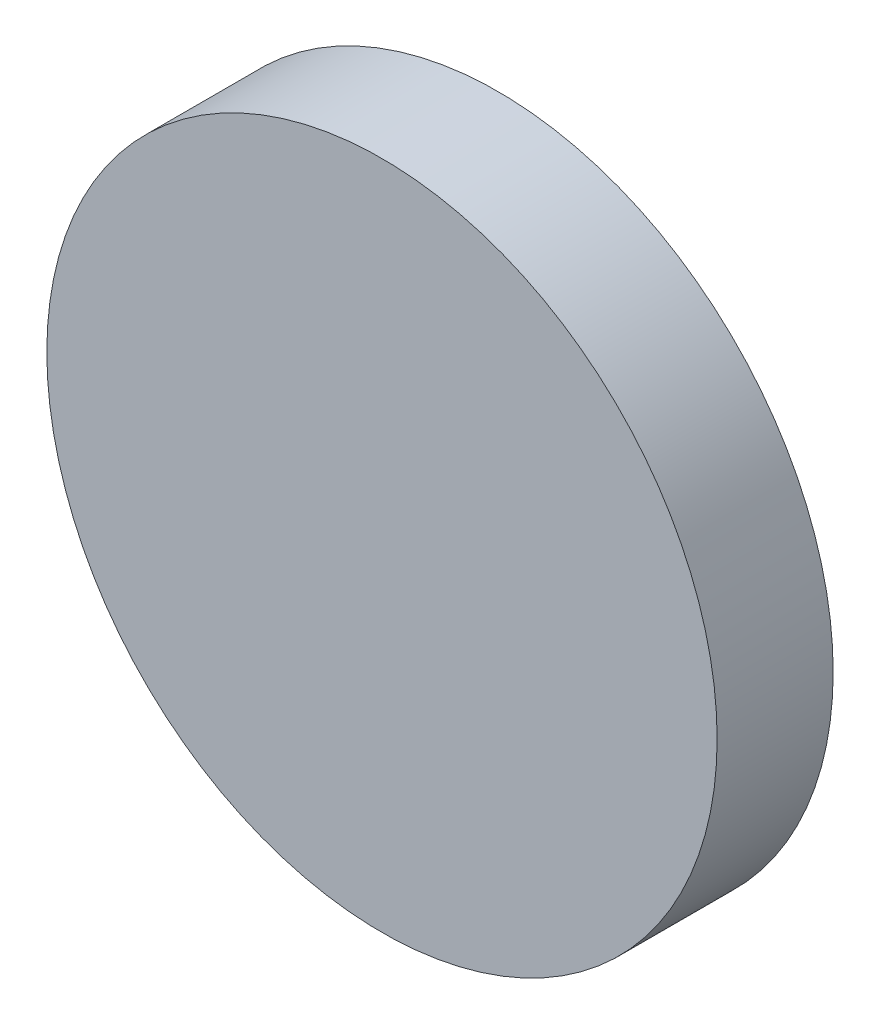
ISO-10303-21;
HEADER;
FILE_DESCRIPTION(('STEP AP214'),'2;1');
FILE_NAME('part.step','',(''),(''),'','','');
FILE_SCHEMA(('AUTOMOTIVE_DESIGN { 1 0 10303 214 1 1 1 1 }'));
ENDSEC;
DATA;
#1=APPLICATION_CONTEXT('core data for automotive mechanical design processes');
#2=APPLICATION_PROTOCOL_DEFINITION('international standard','automotive_design',2000,#1);
#3=PRODUCT_CONTEXT('',#1,'mechanical');
#4=PRODUCT('Part','Part','',(#3));
#5=PRODUCT_RELATED_PRODUCT_CATEGORY('part','',(#4));
#6=PRODUCT_DEFINITION_FORMATION('','',#4);
#7=PRODUCT_DEFINITION_CONTEXT('part definition',#1,'design');
#8=PRODUCT_DEFINITION('design','',#6,#7);
#9=PRODUCT_DEFINITION_SHAPE('','',#8);
#10=(LENGTH_UNIT() NAMED_UNIT(*) SI_UNIT(.MILLI.,.METRE.));
#11=(NAMED_UNIT(*) PLANE_ANGLE_UNIT() SI_UNIT($,.RADIAN.));
#12=(NAMED_UNIT(*) SI_UNIT($,.STERADIAN.) SOLID_ANGLE_UNIT());
#13=UNCERTAINTY_MEASURE_WITH_UNIT(LENGTH_MEASURE(1.E-05),#10,'distance_accuracy_value','');
#14=(GEOMETRIC_REPRESENTATION_CONTEXT(3) GLOBAL_UNCERTAINTY_ASSIGNED_CONTEXT((#13)) GLOBAL_UNIT_ASSIGNED_CONTEXT((#10,
#11,#12)) REPRESENTATION_CONTEXT('',''));
#15=CARTESIAN_POINT('',(0.,0.,0.));
#16=DIRECTION('',(0.,0.,1.));
#17=DIRECTION('',(1.,0.,0.));
#18=AXIS2_PLACEMENT_3D('',#15,#16,#17);
#19=CARTESIAN_POINT('',(0.,0.,22.5));
#20=DIRECTION('',(0.,0.,-1.));
#21=DIRECTION('',(-1.,0.,0.));
#22=AXIS2_PLACEMENT_3D('',#19,#20,#21);
#23=CYLINDRICAL_SURFACE('',#22,65.);
#24=CARTESIAN_POINT('',(0.,0.,22.5));
#25=DIRECTION('',(0.,0.,1.));
#26=DIRECTION('',(1.,0.,0.));
#27=AXIS2_PLACEMENT_3D('',#24,#25,#26);
#28=CIRCLE('',#27,65.);
#29=CARTESIAN_POINT('',(65.,0.,22.5));
#30=VERTEX_POINT('',#29);
#31=EDGE_CURVE('E10',#30,#30,#28,.T.);
#32=ORIENTED_EDGE('',*,*,#31,.F.);
#33=EDGE_LOOP('',(#32));
#34=FACE_BOUND('',#33,.T.);
#35=CARTESIAN_POINT('',(0.,0.,0.));
#36=DIRECTION('',(0.,0.,1.));
#37=DIRECTION('',(1.,0.,0.));
#38=AXIS2_PLACEMENT_3D('',#35,#36,#37);
#39=CIRCLE('',#38,65.);
#40=CARTESIAN_POINT('',(65.,0.,0.));
#41=VERTEX_POINT('',#40);
#42=EDGE_CURVE('E44',#41,#41,#39,.T.);
#43=ORIENTED_EDGE('',*,*,#42,.T.);
#44=EDGE_LOOP('',(#43));
#45=FACE_BOUND('',#44,.T.);
#46=ADVANCED_FACE('F41',(#34,#45),#23,.T.);
#47=CARTESIAN_POINT('',(0.,0.,22.5));
#48=DIRECTION('',(0.,0.,1.));
#49=DIRECTION('',(1.,0.,0.));
#50=AXIS2_PLACEMENT_3D('',#47,#48,#49);
#51=PLANE('',#50);
#52=ORIENTED_EDGE('',*,*,#31,.T.);
#53=EDGE_LOOP('',(#52));
#54=FACE_BOUND('',#53,.T.);
#55=ADVANCED_FACE('F58',(#54),#51,.T.);
#56=CARTESIAN_POINT('',(0.,0.,0.));
#57=DIRECTION('',(0.,0.,1.));
#58=DIRECTION('',(1.,0.,0.));
#59=AXIS2_PLACEMENT_3D('',#56,#57,#58);
#60=PLANE('',#59);
#61=ORIENTED_EDGE('',*,*,#42,.F.);
#62=EDGE_LOOP('',(#61));
#63=FACE_BOUND('',#62,.T.);
#64=ADVANCED_FACE('F56',(#63),#60,.F.);
#65=CLOSED_SHELL('',(#46,#55,#64));
#66=MANIFOLD_SOLID_BREP('B2',#65);
#67=ADVANCED_BREP_SHAPE_REPRESENTATION('',(#18,#66),#14);
#68=SHAPE_DEFINITION_REPRESENTATION(#9,#67);
ENDSEC;
END-ISO-10303-21;
